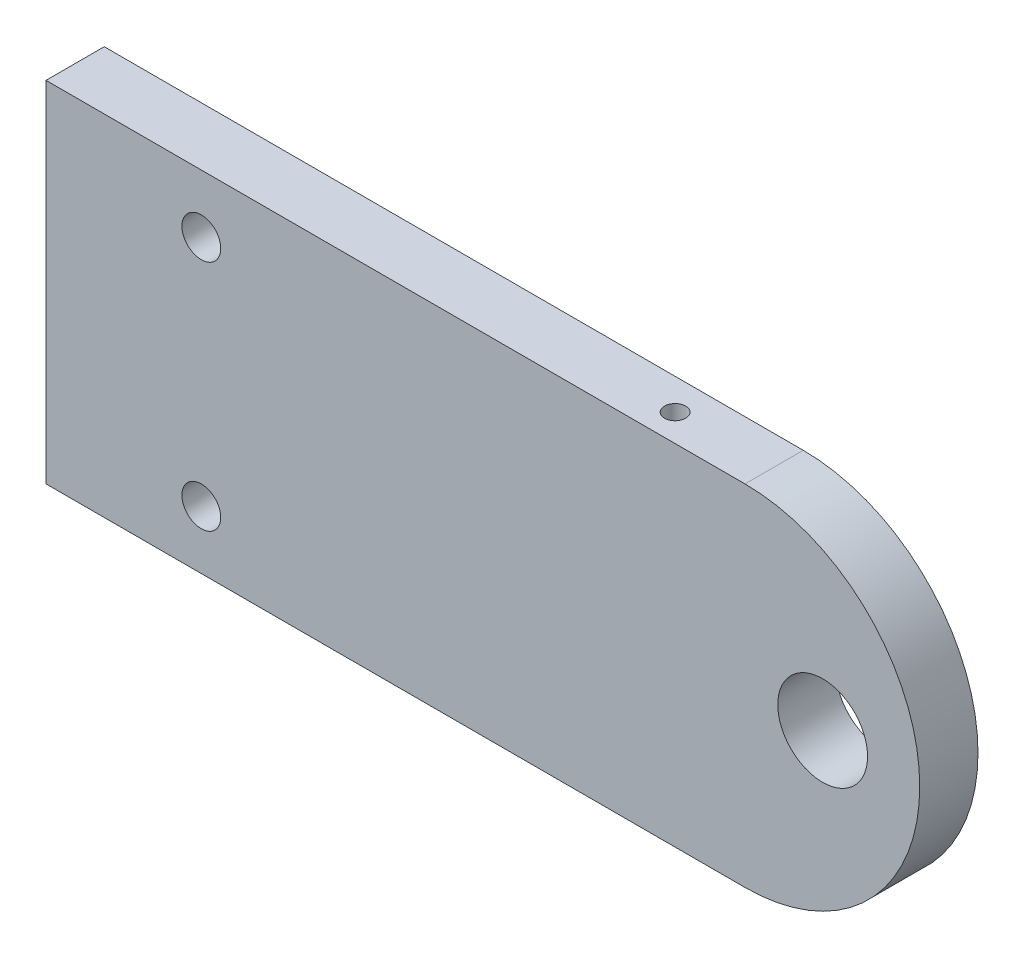
ISO-10303-21;
HEADER;
FILE_DESCRIPTION(('STEP AP214'),'2;1');
FILE_NAME('part.step','',(''),(''),'','','');
FILE_SCHEMA(('AUTOMOTIVE_DESIGN { 1 0 10303 214 1 1 1 1 }'));
ENDSEC;
DATA;
#1=APPLICATION_CONTEXT('core data for automotive mechanical design processes');
#2=APPLICATION_PROTOCOL_DEFINITION('international standard','automotive_design',2000,#1);
#3=PRODUCT_CONTEXT('',#1,'mechanical');
#4=PRODUCT('Part','Part','',(#3));
#5=PRODUCT_RELATED_PRODUCT_CATEGORY('part','',(#4));
#6=PRODUCT_DEFINITION_FORMATION('','',#4);
#7=PRODUCT_DEFINITION_CONTEXT('part definition',#1,'design');
#8=PRODUCT_DEFINITION('design','',#6,#7);
#9=PRODUCT_DEFINITION_SHAPE('','',#8);
#10=(LENGTH_UNIT() NAMED_UNIT(*) SI_UNIT(.MILLI.,.METRE.));
#11=(NAMED_UNIT(*) PLANE_ANGLE_UNIT() SI_UNIT($,.RADIAN.));
#12=(NAMED_UNIT(*) SI_UNIT($,.STERADIAN.) SOLID_ANGLE_UNIT());
#13=UNCERTAINTY_MEASURE_WITH_UNIT(LENGTH_MEASURE(1.E-05),#10,'distance_accuracy_value','');
#14=(GEOMETRIC_REPRESENTATION_CONTEXT(3) GLOBAL_UNCERTAINTY_ASSIGNED_CONTEXT((#13)) GLOBAL_UNIT_ASSIGNED_CONTEXT((#10,
#11,#12)) REPRESENTATION_CONTEXT('',''));
#15=CARTESIAN_POINT('',(0.,0.,0.));
#16=DIRECTION('',(0.,0.,1.));
#17=DIRECTION('',(1.,0.,0.));
#18=AXIS2_PLACEMENT_3D('',#15,#16,#17);
#19=CARTESIAN_POINT('',(0.,0.,9.525));
#20=DIRECTION('',(1.,0.,0.));
#21=DIRECTION('',(0.,0.,-1.));
#22=AXIS2_PLACEMENT_3D('',#19,#20,#21);
#23=PLANE('',#22);
#24=DIRECTION('',(0.,-1.,0.));
#25=VECTOR('',#24,1.);
#26=CARTESIAN_POINT('',(0.,0.,0.));
#27=LINE('',#26,#25);
#28=CARTESIAN_POINT('',(0.,57.15,0.));
#29=VERTEX_POINT('',#28);
#30=CARTESIAN_POINT('',(0.,0.,0.));
#31=VERTEX_POINT('',#30);
#32=EDGE_CURVE('E135',#29,#31,#27,.T.);
#33=ORIENTED_EDGE('',*,*,#32,.T.);
#34=DIRECTION('',(0.,0.,-1.));
#35=VECTOR('',#34,1.);
#36=CARTESIAN_POINT('',(0.,0.,9.525));
#37=LINE('',#36,#35);
#38=CARTESIAN_POINT('',(0.,0.,9.525));
#39=VERTEX_POINT('',#38);
#40=EDGE_CURVE('E11',#39,#31,#37,.T.);
#41=ORIENTED_EDGE('',*,*,#40,.F.);
#42=DIRECTION('',(0.,-1.,0.));
#43=VECTOR('',#42,1.);
#44=CARTESIAN_POINT('',(0.,0.,9.525));
#45=LINE('',#44,#43);
#46=CARTESIAN_POINT('',(0.,57.15,9.525));
#47=VERTEX_POINT('',#46);
#48=EDGE_CURVE('E136',#47,#39,#45,.T.);
#49=ORIENTED_EDGE('',*,*,#48,.F.);
#50=DIRECTION('',(0.,0.,-1.));
#51=VECTOR('',#50,1.);
#52=CARTESIAN_POINT('',(0.,57.15,9.525));
#53=LINE('',#52,#51);
#54=EDGE_CURVE('E146',#47,#29,#53,.T.);
#55=ORIENTED_EDGE('',*,*,#54,.T.);
#56=EDGE_LOOP('',(#33,#41,#49,#55));
#57=FACE_BOUND('',#56,.T.);
#58=ADVANCED_FACE('F42',(#57),#23,.F.);
#59=CARTESIAN_POINT('',(0.,0.,9.525));
#60=DIRECTION('',(0.,1.,0.));
#61=DIRECTION('',(0.,0.,1.));
#62=AXIS2_PLACEMENT_3D('',#59,#60,#61);
#63=PLANE('',#62);
#64=DIRECTION('',(1.,0.,0.));
#65=VECTOR('',#64,1.);
#66=CARTESIAN_POINT('',(0.,0.,0.));
#67=LINE('',#66,#65);
#68=CARTESIAN_POINT('',(114.3,0.,0.));
#69=VERTEX_POINT('',#68);
#70=EDGE_CURVE('E150',#31,#69,#67,.T.);
#71=ORIENTED_EDGE('',*,*,#70,.T.);
#72=DIRECTION('',(0.,0.,-1.));
#73=VECTOR('',#72,1.);
#74=CARTESIAN_POINT('',(114.3,0.,9.525));
#75=LINE('',#74,#73);
#76=CARTESIAN_POINT('',(114.3,0.,9.525));
#77=VERTEX_POINT('',#76);
#78=EDGE_CURVE('E51',#77,#69,#75,.T.);
#79=ORIENTED_EDGE('',*,*,#78,.F.);
#80=DIRECTION('',(1.,0.,0.));
#81=VECTOR('',#80,1.);
#82=CARTESIAN_POINT('',(0.,0.,9.525));
#83=LINE('',#82,#81);
#84=EDGE_CURVE('E90',#39,#77,#83,.T.);
#85=ORIENTED_EDGE('',*,*,#84,.F.);
#86=ORIENTED_EDGE('',*,*,#40,.T.);
#87=EDGE_LOOP('',(#71,#79,#85,#86));
#88=FACE_BOUND('',#87,.T.);
#89=ADVANCED_FACE('F182',(#88),#63,.F.);
#90=CARTESIAN_POINT('',(114.3,28.575,9.525));
#91=DIRECTION('',(0.,0.,-1.));
#92=DIRECTION('',(-1.,0.,0.));
#93=AXIS2_PLACEMENT_3D('',#90,#91,#92);
#94=CYLINDRICAL_SURFACE('',#93,28.575);
#95=CARTESIAN_POINT('',(114.3,28.575,0.));
#96=DIRECTION('',(0.,0.,1.));
#97=DIRECTION('',(-1.,0.,0.));
#98=AXIS2_PLACEMENT_3D('',#95,#96,#97);
#99=CIRCLE('',#98,28.575);
#100=CARTESIAN_POINT('',(114.3,57.15,0.));
#101=VERTEX_POINT('',#100);
#102=EDGE_CURVE('E77',#69,#101,#99,.T.);
#103=ORIENTED_EDGE('',*,*,#102,.T.);
#104=DIRECTION('',(0.,0.,-1.));
#105=VECTOR('',#104,1.);
#106=CARTESIAN_POINT('',(114.3,57.15,9.525));
#107=LINE('',#106,#105);
#108=CARTESIAN_POINT('',(114.3,57.15,9.525));
#109=VERTEX_POINT('',#108);
#110=EDGE_CURVE('E159',#109,#101,#107,.T.);
#111=ORIENTED_EDGE('',*,*,#110,.F.);
#112=CARTESIAN_POINT('',(114.3,28.575,9.525));
#113=DIRECTION('',(0.,0.,1.));
#114=DIRECTION('',(-1.,0.,0.));
#115=AXIS2_PLACEMENT_3D('',#112,#113,#114);
#116=CIRCLE('',#115,28.575);
#117=EDGE_CURVE('E141',#77,#109,#116,.T.);
#118=ORIENTED_EDGE('',*,*,#117,.F.);
#119=ORIENTED_EDGE('',*,*,#78,.T.);
#120=EDGE_LOOP('',(#103,#111,#118,#119));
#121=FACE_BOUND('',#120,.T.);
#122=ADVANCED_FACE('F163',(#121),#94,.T.);
#123=CARTESIAN_POINT('',(0.,57.15,9.525));
#124=DIRECTION('',(0.,-1.,0.));
#125=DIRECTION('',(0.,0.,-1.));
#126=AXIS2_PLACEMENT_3D('',#123,#124,#125);
#127=PLANE('',#126);
#128=CARTESIAN_POINT('',(98.425,57.15,5.08));
#129=DIRECTION('',(0.,1.,0.));
#130=DIRECTION('',(0.,0.,1.));
#131=AXIS2_PLACEMENT_3D('',#128,#129,#130);
#132=CIRCLE('',#131,1.7272);
#133=CARTESIAN_POINT('',(98.425,57.15,6.8072));
#134=VERTEX_POINT('',#133);
#135=EDGE_CURVE('E106',#134,#134,#132,.T.);
#136=ORIENTED_EDGE('',*,*,#135,.F.);
#137=EDGE_LOOP('',(#136));
#138=FACE_BOUND('',#137,.T.);
#139=DIRECTION('',(-1.,0.,0.));
#140=VECTOR('',#139,1.);
#141=CARTESIAN_POINT('',(0.,57.15,0.));
#142=LINE('',#141,#140);
#143=EDGE_CURVE('E83',#101,#29,#142,.T.);
#144=ORIENTED_EDGE('',*,*,#143,.T.);
#145=ORIENTED_EDGE('',*,*,#54,.F.);
#146=DIRECTION('',(-1.,0.,0.));
#147=VECTOR('',#146,1.);
#148=CARTESIAN_POINT('',(0.,57.15,9.525));
#149=LINE('',#148,#147);
#150=EDGE_CURVE('E59',#109,#47,#149,.T.);
#151=ORIENTED_EDGE('',*,*,#150,.F.);
#152=ORIENTED_EDGE('',*,*,#110,.T.);
#153=EDGE_LOOP('',(#144,#145,#151,#152));
#154=FACE_BOUND('',#153,.T.);
#155=ADVANCED_FACE('F170',(#138,#154),#127,.F.);
#156=CARTESIAN_POINT('',(114.3,28.575,9.525));
#157=DIRECTION('',(0.,0.,-1.));
#158=DIRECTION('',(-1.,0.,0.));
#159=AXIS2_PLACEMENT_3D('',#156,#157,#158);
#160=PLANE('',#159);
#161=CARTESIAN_POINT('',(25.4,47.625,9.525));
#162=DIRECTION('',(0.,0.,1.));
#163=DIRECTION('',(1.,0.,0.));
#164=AXIS2_PLACEMENT_3D('',#161,#162,#163);
#165=CIRCLE('',#164,3.17499999999999);
#166=CARTESIAN_POINT('',(28.575,47.625,9.525));
#167=VERTEX_POINT('',#166);
#168=EDGE_CURVE('E105',#167,#167,#165,.T.);
#169=ORIENTED_EDGE('',*,*,#168,.F.);
#170=EDGE_LOOP('',(#169));
#171=FACE_BOUND('',#170,.T.);
#172=CARTESIAN_POINT('',(25.4,9.525,9.525));
#173=DIRECTION('',(0.,0.,1.));
#174=DIRECTION('',(1.,0.,0.));
#175=AXIS2_PLACEMENT_3D('',#172,#173,#174);
#176=CIRCLE('',#175,3.17499999999999);
#177=CARTESIAN_POINT('',(28.575,9.525,9.525));
#178=VERTEX_POINT('',#177);
#179=EDGE_CURVE('E119',#178,#178,#176,.T.);
#180=ORIENTED_EDGE('',*,*,#179,.F.);
#181=EDGE_LOOP('',(#180));
#182=FACE_BOUND('',#181,.T.);
#183=CARTESIAN_POINT('',(127.,28.575,9.525));
#184=DIRECTION('',(0.,0.,1.));
#185=DIRECTION('',(1.,0.,0.));
#186=AXIS2_PLACEMENT_3D('',#183,#184,#185);
#187=CIRCLE('',#186,7.34186999999997);
#188=CARTESIAN_POINT('',(134.34187,28.575,9.525));
#189=VERTEX_POINT('',#188);
#190=EDGE_CURVE('E127',#189,#189,#187,.T.);
#191=ORIENTED_EDGE('',*,*,#190,.F.);
#192=EDGE_LOOP('',(#191));
#193=FACE_BOUND('',#192,.T.);
#194=ORIENTED_EDGE('',*,*,#48,.T.);
#195=ORIENTED_EDGE('',*,*,#84,.T.);
#196=ORIENTED_EDGE('',*,*,#117,.T.);
#197=ORIENTED_EDGE('',*,*,#150,.T.);
#198=EDGE_LOOP('',(#194,#195,#196,#197));
#199=FACE_BOUND('',#198,.T.);
#200=ADVANCED_FACE('F172',(#171,#182,#193,#199),#160,.F.);
#201=CARTESIAN_POINT('',(114.3,28.575,0.));
#202=DIRECTION('',(0.,0.,-1.));
#203=DIRECTION('',(-1.,0.,0.));
#204=AXIS2_PLACEMENT_3D('',#201,#202,#203);
#205=PLANE('',#204);
#206=CARTESIAN_POINT('',(25.4,47.625,0.));
#207=DIRECTION('',(0.,0.,1.));
#208=DIRECTION('',(1.,0.,0.));
#209=AXIS2_PLACEMENT_3D('',#206,#207,#208);
#210=CIRCLE('',#209,3.175);
#211=CARTESIAN_POINT('',(28.575,47.625,0.));
#212=VERTEX_POINT('',#211);
#213=EDGE_CURVE('E111',#212,#212,#210,.T.);
#214=ORIENTED_EDGE('',*,*,#213,.T.);
#215=EDGE_LOOP('',(#214));
#216=FACE_BOUND('',#215,.T.);
#217=CARTESIAN_POINT('',(25.4,9.525,0.));
#218=DIRECTION('',(0.,0.,1.));
#219=DIRECTION('',(1.,0.,0.));
#220=AXIS2_PLACEMENT_3D('',#217,#218,#219);
#221=CIRCLE('',#220,3.175);
#222=CARTESIAN_POINT('',(28.575,9.525,0.));
#223=VERTEX_POINT('',#222);
#224=EDGE_CURVE('E123',#223,#223,#221,.T.);
#225=ORIENTED_EDGE('',*,*,#224,.T.);
#226=EDGE_LOOP('',(#225));
#227=FACE_BOUND('',#226,.T.);
#228=CARTESIAN_POINT('',(127.,28.575,0.));
#229=DIRECTION('',(0.,0.,1.));
#230=DIRECTION('',(1.,0.,0.));
#231=AXIS2_PLACEMENT_3D('',#228,#229,#230);
#232=CIRCLE('',#231,7.34187);
#233=CARTESIAN_POINT('',(134.34187,28.575,0.));
#234=VERTEX_POINT('',#233);
#235=EDGE_CURVE('E131',#234,#234,#232,.T.);
#236=ORIENTED_EDGE('',*,*,#235,.T.);
#237=EDGE_LOOP('',(#236));
#238=FACE_BOUND('',#237,.T.);
#239=ORIENTED_EDGE('',*,*,#32,.F.);
#240=ORIENTED_EDGE('',*,*,#143,.F.);
#241=ORIENTED_EDGE('',*,*,#102,.F.);
#242=ORIENTED_EDGE('',*,*,#70,.F.);
#243=EDGE_LOOP('',(#239,#240,#241,#242));
#244=FACE_BOUND('',#243,.T.);
#245=ADVANCED_FACE('F166',(#216,#227,#238,#244),#205,.T.);
#246=CARTESIAN_POINT('',(127.,28.575,9.525));
#247=DIRECTION('',(0.,0.,1.));
#248=DIRECTION('',(1.,0.,0.));
#249=AXIS2_PLACEMENT_3D('',#246,#247,#248);
#250=CYLINDRICAL_SURFACE('',#249,7.34186999999999);
#251=ORIENTED_EDGE('',*,*,#235,.F.);
#252=EDGE_LOOP('',(#251));
#253=FACE_BOUND('',#252,.T.);
#254=ORIENTED_EDGE('',*,*,#190,.T.);
#255=EDGE_LOOP('',(#254));
#256=FACE_BOUND('',#255,.T.);
#257=ADVANCED_FACE('F219',(#253,#256),#250,.F.);
#258=CARTESIAN_POINT('',(25.4,9.525,9.525));
#259=DIRECTION('',(0.,0.,1.));
#260=DIRECTION('',(1.,0.,0.));
#261=AXIS2_PLACEMENT_3D('',#258,#259,#260);
#262=CYLINDRICAL_SURFACE('',#261,3.17499999999999);
#263=ORIENTED_EDGE('',*,*,#224,.F.);
#264=EDGE_LOOP('',(#263));
#265=FACE_BOUND('',#264,.T.);
#266=ORIENTED_EDGE('',*,*,#179,.T.);
#267=EDGE_LOOP('',(#266));
#268=FACE_BOUND('',#267,.T.);
#269=ADVANCED_FACE('F228',(#265,#268),#262,.F.);
#270=CARTESIAN_POINT('',(25.4,47.625,9.525));
#271=DIRECTION('',(0.,0.,1.));
#272=DIRECTION('',(1.,0.,0.));
#273=AXIS2_PLACEMENT_3D('',#270,#271,#272);
#274=CYLINDRICAL_SURFACE('',#273,3.17499999999999);
#275=ORIENTED_EDGE('',*,*,#213,.F.);
#276=EDGE_LOOP('',(#275));
#277=FACE_BOUND('',#276,.T.);
#278=ORIENTED_EDGE('',*,*,#168,.T.);
#279=EDGE_LOOP('',(#278));
#280=FACE_BOUND('',#279,.T.);
#281=ADVANCED_FACE('F98',(#277,#280),#274,.F.);
#282=CARTESIAN_POINT('',(98.425,44.45,5.08));
#283=DIRECTION('',(0.,1.,0.));
#284=DIRECTION('',(0.,0.,1.));
#285=AXIS2_PLACEMENT_3D('',#282,#283,#284);
#286=CONICAL_SURFACE('',#285,1.7272,1.02974425867665);
#287=CARTESIAN_POINT('',(98.425,43.4121935388156,5.08));
#288=VERTEX_POINT('',#287);
#289=VERTEX_LOOP('',#288);
#290=FACE_BOUND('',#289,.T.);
#291=CARTESIAN_POINT('',(98.425,44.45,5.08));
#292=DIRECTION('',(0.,1.,0.));
#293=DIRECTION('',(0.,0.,1.));
#294=AXIS2_PLACEMENT_3D('',#291,#292,#293);
#295=CIRCLE('',#294,1.7272);
#296=CARTESIAN_POINT('',(98.425,44.45,6.8072));
#297=VERTEX_POINT('',#296);
#298=EDGE_CURVE('E102',#297,#297,#295,.T.);
#299=ORIENTED_EDGE('',*,*,#298,.T.);
#300=EDGE_LOOP('',(#299));
#301=FACE_BOUND('',#300,.T.);
#302=ADVANCED_FACE('F94',(#290,#301),#286,.F.);
#303=CARTESIAN_POINT('',(98.425,57.15,5.08));
#304=DIRECTION('',(0.,1.,0.));
#305=DIRECTION('',(0.,0.,1.));
#306=AXIS2_PLACEMENT_3D('',#303,#304,#305);
#307=CYLINDRICAL_SURFACE('',#306,1.7272);
#308=ORIENTED_EDGE('',*,*,#298,.F.);
#309=EDGE_LOOP('',(#308));
#310=FACE_BOUND('',#309,.T.);
#311=ORIENTED_EDGE('',*,*,#135,.T.);
#312=EDGE_LOOP('',(#311));
#313=FACE_BOUND('',#312,.T.);
#314=ADVANCED_FACE('F97',(#310,#313),#307,.F.);
#315=CLOSED_SHELL('',(#58,#89,#122,#155,#200,#245,#257,#269,#281,#302,#314));
#316=MANIFOLD_SOLID_BREP('B2',#315);
#317=ADVANCED_BREP_SHAPE_REPRESENTATION('',(#18,#316),#14);
#318=SHAPE_DEFINITION_REPRESENTATION(#9,#317);
ENDSEC;
END-ISO-10303-21;
